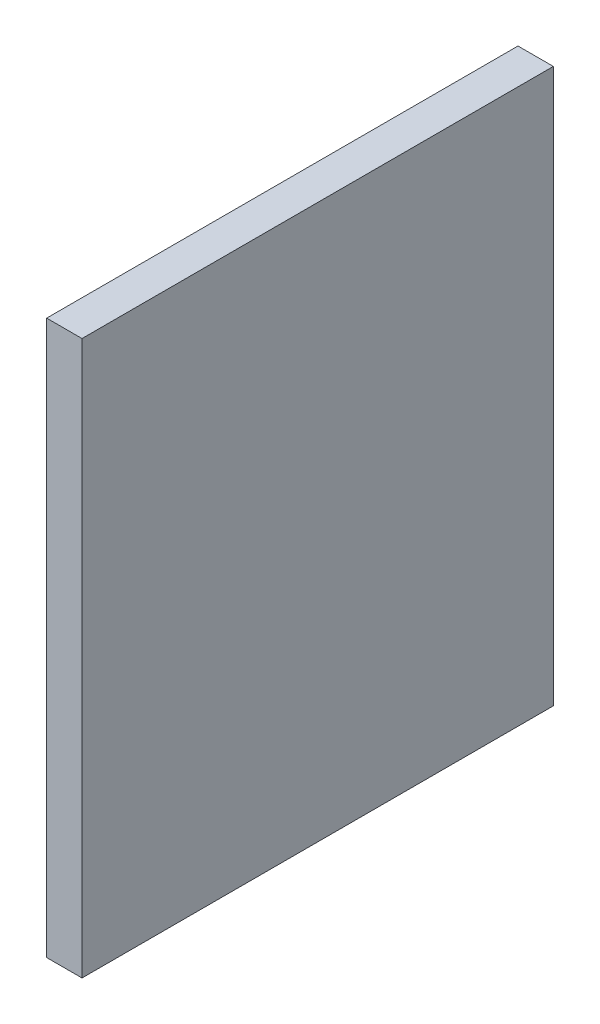
ISO-10303-21;
HEADER;
FILE_DESCRIPTION(('STEP AP214'),'2;1');
FILE_NAME('part.step','',(''),(''),'','','');
FILE_SCHEMA(('AUTOMOTIVE_DESIGN { 1 0 10303 214 1 1 1 1 }'));
ENDSEC;
DATA;
#1=APPLICATION_CONTEXT('core data for automotive mechanical design processes');
#2=APPLICATION_PROTOCOL_DEFINITION('international standard','automotive_design',2000,#1);
#3=PRODUCT_CONTEXT('',#1,'mechanical');
#4=PRODUCT('Part','Part','',(#3));
#5=PRODUCT_RELATED_PRODUCT_CATEGORY('part','',(#4));
#6=PRODUCT_DEFINITION_FORMATION('','',#4);
#7=PRODUCT_DEFINITION_CONTEXT('part definition',#1,'design');
#8=PRODUCT_DEFINITION('design','',#6,#7);
#9=PRODUCT_DEFINITION_SHAPE('','',#8);
#10=(LENGTH_UNIT() NAMED_UNIT(*) SI_UNIT(.MILLI.,.METRE.));
#11=(NAMED_UNIT(*) PLANE_ANGLE_UNIT() SI_UNIT($,.RADIAN.));
#12=(NAMED_UNIT(*) SI_UNIT($,.STERADIAN.) SOLID_ANGLE_UNIT());
#13=UNCERTAINTY_MEASURE_WITH_UNIT(LENGTH_MEASURE(1.E-05),#10,'distance_accuracy_value','');
#14=(GEOMETRIC_REPRESENTATION_CONTEXT(3) GLOBAL_UNCERTAINTY_ASSIGNED_CONTEXT((#13)) GLOBAL_UNIT_ASSIGNED_CONTEXT((#10,
#11,#12)) REPRESENTATION_CONTEXT('',''));
#15=CARTESIAN_POINT('',(0.,0.,0.));
#16=DIRECTION('',(0.,0.,1.));
#17=DIRECTION('',(1.,0.,0.));
#18=AXIS2_PLACEMENT_3D('',#15,#16,#17);
#19=CARTESIAN_POINT('',(-98.3544303797468,-0.0100000000000031,-32.8481012658228));
#20=DIRECTION('',(0.,0.,-1.));
#21=DIRECTION('',(-1.,0.,0.));
#22=AXIS2_PLACEMENT_3D('',#19,#20,#21);
#23=PLANE('',#22);
#24=DIRECTION('',(0.,1.,0.));
#25=VECTOR('',#24,1.);
#26=CARTESIAN_POINT('',(-95.3544303797468,-0.0100000000000031,-32.8481012658228));
#27=LINE('',#26,#25);
#28=CARTESIAN_POINT('',(-95.3544303797468,0.,-32.8481012658228));
#29=VERTEX_POINT('',#28);
#30=CARTESIAN_POINT('',(-95.3544303797468,47.,-32.8481012658228));
#31=VERTEX_POINT('',#30);
#32=EDGE_CURVE('E11',#29,#31,#27,.T.);
#33=ORIENTED_EDGE('',*,*,#32,.F.);
#34=DIRECTION('',(-1.,0.,0.));
#35=VECTOR('',#34,1.);
#36=CARTESIAN_POINT('',(0.,0.,-32.8481012658228));
#37=LINE('',#36,#35);
#38=CARTESIAN_POINT('',(-98.3544303797468,0.,-32.8481012658228));
#39=VERTEX_POINT('',#38);
#40=EDGE_CURVE('E97',#29,#39,#37,.T.);
#41=ORIENTED_EDGE('',*,*,#40,.T.);
#42=DIRECTION('',(0.,1.,0.));
#43=VECTOR('',#42,1.);
#44=CARTESIAN_POINT('',(-98.3544303797468,50.,-32.8481012658228));
#45=LINE('',#44,#43);
#46=CARTESIAN_POINT('',(-98.3544303797468,47.,-32.8481012658228));
#47=VERTEX_POINT('',#46);
#48=EDGE_CURVE('E77',#39,#47,#45,.T.);
#49=ORIENTED_EDGE('',*,*,#48,.T.);
#50=DIRECTION('',(-1.,0.,0.));
#51=VECTOR('',#50,1.);
#52=CARTESIAN_POINT('',(0.,47.,-32.8481012658228));
#53=LINE('',#52,#51);
#54=EDGE_CURVE('E75',#31,#47,#53,.T.);
#55=ORIENTED_EDGE('',*,*,#54,.F.);
#56=EDGE_LOOP('',(#33,#41,#49,#55));
#57=FACE_BOUND('',#56,.T.);
#58=ADVANCED_FACE('F32',(#57),#23,.T.);
#59=CARTESIAN_POINT('',(-95.3544303797468,-0.0100000000000031,-32.8481012658228));
#60=DIRECTION('',(1.,0.,0.));
#61=DIRECTION('',(0.,0.,-1.));
#62=AXIS2_PLACEMENT_3D('',#59,#60,#61);
#63=PLANE('',#62);
#64=DIRECTION('',(0.,1.,0.));
#65=VECTOR('',#64,1.);
#66=CARTESIAN_POINT('',(-95.3544303797468,-0.0100000000000031,7.15189873417722));
#67=LINE('',#66,#65);
#68=CARTESIAN_POINT('',(-95.3544303797468,0.,7.15189873417722));
#69=VERTEX_POINT('',#68);
#70=CARTESIAN_POINT('',(-95.3544303797468,47.,7.15189873417722));
#71=VERTEX_POINT('',#70);
#72=EDGE_CURVE('E40',#69,#71,#67,.T.);
#73=ORIENTED_EDGE('',*,*,#72,.F.);
#74=DIRECTION('',(0.,0.,-1.));
#75=VECTOR('',#74,1.);
#76=CARTESIAN_POINT('',(-95.3544303797468,0.,0.));
#77=LINE('',#76,#75);
#78=EDGE_CURVE('E73',#69,#29,#77,.T.);
#79=ORIENTED_EDGE('',*,*,#78,.T.);
#80=ORIENTED_EDGE('',*,*,#32,.T.);
#81=DIRECTION('',(0.,0.,1.));
#82=VECTOR('',#81,1.);
#83=CARTESIAN_POINT('',(-95.3544303797468,47.,-47.8481012658228));
#84=LINE('',#83,#82);
#85=EDGE_CURVE('E71',#31,#71,#84,.T.);
#86=ORIENTED_EDGE('',*,*,#85,.T.);
#87=EDGE_LOOP('',(#73,#79,#80,#86));
#88=FACE_BOUND('',#87,.T.);
#89=ADVANCED_FACE('F69',(#88),#63,.T.);
#90=CARTESIAN_POINT('',(-98.3544303797468,-0.0100000000000031,7.15189873417722));
#91=DIRECTION('',(0.,0.,1.));
#92=DIRECTION('',(1.,0.,0.));
#93=AXIS2_PLACEMENT_3D('',#90,#91,#92);
#94=PLANE('',#93);
#95=DIRECTION('',(0.,-1.,0.));
#96=VECTOR('',#95,1.);
#97=CARTESIAN_POINT('',(-98.3544303797468,50.,7.15189873417722));
#98=LINE('',#97,#96);
#99=CARTESIAN_POINT('',(-98.3544303797468,47.,7.15189873417722));
#100=VERTEX_POINT('',#99);
#101=CARTESIAN_POINT('',(-98.3544303797468,0.,7.15189873417722));
#102=VERTEX_POINT('',#101);
#103=EDGE_CURVE('E94',#100,#102,#98,.T.);
#104=ORIENTED_EDGE('',*,*,#103,.T.);
#105=DIRECTION('',(1.,0.,0.));
#106=VECTOR('',#105,1.);
#107=CARTESIAN_POINT('',(0.,0.,7.15189873417733));
#108=LINE('',#107,#106);
#109=EDGE_CURVE('E92',#102,#69,#108,.T.);
#110=ORIENTED_EDGE('',*,*,#109,.T.);
#111=ORIENTED_EDGE('',*,*,#72,.T.);
#112=DIRECTION('',(1.,0.,0.));
#113=VECTOR('',#112,1.);
#114=CARTESIAN_POINT('',(0.,47.,7.15189873417733));
#115=LINE('',#114,#113);
#116=EDGE_CURVE('E81',#100,#71,#115,.T.);
#117=ORIENTED_EDGE('',*,*,#116,.F.);
#118=EDGE_LOOP('',(#104,#110,#111,#117));
#119=FACE_BOUND('',#118,.T.);
#120=ADVANCED_FACE('F102',(#119),#94,.T.);
#121=CARTESIAN_POINT('',(-98.3544303797468,50.,-47.8481012658228));
#122=DIRECTION('',(1.,0.,0.));
#123=DIRECTION('',(0.,0.,-1.));
#124=AXIS2_PLACEMENT_3D('',#121,#122,#123);
#125=PLANE('',#124);
#126=ORIENTED_EDGE('',*,*,#103,.F.);
#127=DIRECTION('',(0.,0.,1.));
#128=VECTOR('',#127,1.);
#129=CARTESIAN_POINT('',(-98.3544303797468,47.,-47.8481012658228));
#130=LINE('',#129,#128);
#131=EDGE_CURVE('E85',#47,#100,#130,.T.);
#132=ORIENTED_EDGE('',*,*,#131,.F.);
#133=ORIENTED_EDGE('',*,*,#48,.F.);
#134=DIRECTION('',(0.,0.,1.));
#135=VECTOR('',#134,1.);
#136=CARTESIAN_POINT('',(-98.3544303797468,0.,-47.8481012658228));
#137=LINE('',#136,#135);
#138=EDGE_CURVE('E90',#39,#102,#137,.T.);
#139=ORIENTED_EDGE('',*,*,#138,.T.);
#140=EDGE_LOOP('',(#126,#132,#133,#139));
#141=FACE_BOUND('',#140,.T.);
#142=ADVANCED_FACE('F34',(#141),#125,.F.);
#143=CARTESIAN_POINT('',(0.,0.,0.));
#144=DIRECTION('',(0.,1.,0.));
#145=DIRECTION('',(0.,0.,1.));
#146=AXIS2_PLACEMENT_3D('',#143,#144,#145);
#147=PLANE('',#146);
#148=ORIENTED_EDGE('',*,*,#109,.F.);
#149=ORIENTED_EDGE('',*,*,#138,.F.);
#150=ORIENTED_EDGE('',*,*,#40,.F.);
#151=ORIENTED_EDGE('',*,*,#78,.F.);
#152=EDGE_LOOP('',(#148,#149,#150,#151));
#153=FACE_BOUND('',#152,.T.);
#154=ADVANCED_FACE('F105',(#153),#147,.F.);
#155=CARTESIAN_POINT('',(0.,47.,0.));
#156=DIRECTION('',(0.,1.,0.));
#157=DIRECTION('',(0.,0.,1.));
#158=AXIS2_PLACEMENT_3D('',#155,#156,#157);
#159=PLANE('',#158);
#160=ORIENTED_EDGE('',*,*,#131,.T.);
#161=ORIENTED_EDGE('',*,*,#116,.T.);
#162=ORIENTED_EDGE('',*,*,#85,.F.);
#163=ORIENTED_EDGE('',*,*,#54,.T.);
#164=EDGE_LOOP('',(#160,#161,#162,#163));
#165=FACE_BOUND('',#164,.T.);
#166=ADVANCED_FACE('F83',(#165),#159,.T.);
#167=CLOSED_SHELL('',(#58,#89,#120,#142,#154,#166));
#168=MANIFOLD_SOLID_BREP('B2',#167);
#169=ADVANCED_BREP_SHAPE_REPRESENTATION('',(#18,#168),#14);
#170=SHAPE_DEFINITION_REPRESENTATION(#9,#169);
ENDSEC;
END-ISO-10303-21;
